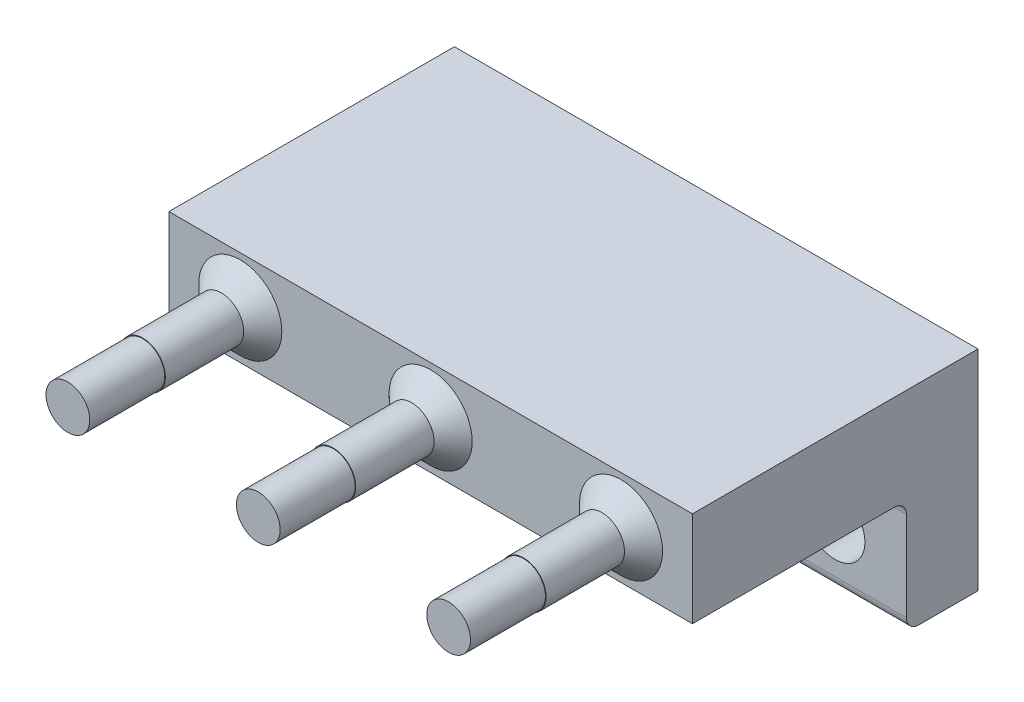
ISO-10303-21;
HEADER;
FILE_DESCRIPTION(('STEP AP214'),'2;1');
FILE_NAME('part.step','',(''),(''),'','','');
FILE_SCHEMA(('AUTOMOTIVE_DESIGN { 1 0 10303 214 1 1 1 1 }'));
ENDSEC;
DATA;
#1=APPLICATION_CONTEXT('core data for automotive mechanical design processes');
#2=APPLICATION_PROTOCOL_DEFINITION('international standard','automotive_design',2000,#1);
#3=PRODUCT_CONTEXT('',#1,'mechanical');
#4=PRODUCT('Part','Part','',(#3));
#5=PRODUCT_RELATED_PRODUCT_CATEGORY('part','',(#4));
#6=PRODUCT_DEFINITION_FORMATION('','',#4);
#7=PRODUCT_DEFINITION_CONTEXT('part definition',#1,'design');
#8=PRODUCT_DEFINITION('design','',#6,#7);
#9=PRODUCT_DEFINITION_SHAPE('','',#8);
#10=(LENGTH_UNIT() NAMED_UNIT(*) SI_UNIT(.MILLI.,.METRE.));
#11=(NAMED_UNIT(*) PLANE_ANGLE_UNIT() SI_UNIT($,.RADIAN.));
#12=(NAMED_UNIT(*) SI_UNIT($,.STERADIAN.) SOLID_ANGLE_UNIT());
#13=UNCERTAINTY_MEASURE_WITH_UNIT(LENGTH_MEASURE(1.E-05),#10,'distance_accuracy_value','');
#14=(GEOMETRIC_REPRESENTATION_CONTEXT(3) GLOBAL_UNCERTAINTY_ASSIGNED_CONTEXT((#13)) GLOBAL_UNIT_ASSIGNED_CONTEXT((#10,
#11,#12)) REPRESENTATION_CONTEXT('',''));
#15=CARTESIAN_POINT('',(0.,0.,0.));
#16=DIRECTION('',(0.,0.,1.));
#17=DIRECTION('',(1.,0.,0.));
#18=AXIS2_PLACEMENT_3D('',#15,#16,#17);
#19=CARTESIAN_POINT('',(23.8125,11.1125,0.));
#20=DIRECTION('',(0.,1.,0.));
#21=DIRECTION('',(1.,0.,0.));
#22=AXIS2_PLACEMENT_3D('',#19,#20,#21);
#23=PLANE('',#22);
#24=DIRECTION('',(-1.,0.,0.));
#25=VECTOR('',#24,1.);
#26=CARTESIAN_POINT('',(23.8125,11.1125,0.));
#27=LINE('',#26,#25);
#28=CARTESIAN_POINT('',(23.8125,11.1125,0.));
#29=VERTEX_POINT('',#28);
#30=CARTESIAN_POINT('',(-11.1125,11.1125,0.));
#31=VERTEX_POINT('',#30);
#32=EDGE_CURVE('E336',#29,#31,#27,.T.);
#33=ORIENTED_EDGE('',*,*,#32,.T.);
#34=DIRECTION('',(0.,0.,1.));
#35=VECTOR('',#34,1.);
#36=CARTESIAN_POINT('',(-11.1125,11.1125,0.));
#37=LINE('',#36,#35);
#38=CARTESIAN_POINT('',(-11.1125,11.1125,19.05));
#39=VERTEX_POINT('',#38);
#40=EDGE_CURVE('E307',#31,#39,#37,.T.);
#41=ORIENTED_EDGE('',*,*,#40,.T.);
#42=DIRECTION('',(-1.,0.,0.));
#43=VECTOR('',#42,1.);
#44=CARTESIAN_POINT('',(23.8125,11.1125,19.05));
#45=LINE('',#44,#43);
#46=CARTESIAN_POINT('',(23.8125,11.1125,19.05));
#47=VERTEX_POINT('',#46);
#48=EDGE_CURVE('E248',#47,#39,#45,.T.);
#49=ORIENTED_EDGE('',*,*,#48,.F.);
#50=DIRECTION('',(0.,0.,1.));
#51=VECTOR('',#50,1.);
#52=CARTESIAN_POINT('',(23.8125,11.1125,0.));
#53=LINE('',#52,#51);
#54=EDGE_CURVE('E289',#29,#47,#53,.T.);
#55=ORIENTED_EDGE('',*,*,#54,.F.);
#56=EDGE_LOOP('',(#33,#41,#49,#55));
#57=FACE_BOUND('',#56,.T.);
#58=ADVANCED_FACE('F17',(#57),#23,.T.);
#59=CARTESIAN_POINT('',(19.05,7.93749864998746,25.55));
#60=DIRECTION('',(0.,0.,1.));
#61=DIRECTION('',(1.,0.,0.));
#62=AXIS2_PLACEMENT_3D('',#59,#60,#61);
#63=PLANE('',#62);
#64=CARTESIAN_POINT('',(19.05,7.93749864998746,25.55));
#65=DIRECTION('',(0.,0.,-1.));
#66=DIRECTION('',(1.,0.,0.));
#67=AXIS2_PLACEMENT_3D('',#64,#65,#66);
#68=CIRCLE('',#67,1.46);
#69=CARTESIAN_POINT('',(17.59,7.93749864998746,25.55));
#70=VERTEX_POINT('',#69);
#71=EDGE_CURVE('E374',#70,#70,#68,.T.);
#72=ORIENTED_EDGE('',*,*,#71,.T.);
#73=EDGE_LOOP('',(#72));
#74=FACE_BOUND('',#73,.T.);
#75=CARTESIAN_POINT('',(19.05,7.93749864998746,25.55));
#76=DIRECTION('',(0.,0.,1.));
#77=DIRECTION('',(1.,0.,0.));
#78=AXIS2_PLACEMENT_3D('',#75,#76,#77);
#79=CIRCLE('',#78,1.5);
#80=CARTESIAN_POINT('',(17.55,7.93749864998746,25.55));
#81=VERTEX_POINT('',#80);
#82=EDGE_CURVE('E322',#81,#81,#79,.T.);
#83=ORIENTED_EDGE('',*,*,#82,.T.);
#84=EDGE_LOOP('',(#83));
#85=FACE_BOUND('',#84,.T.);
#86=ADVANCED_FACE('F452',(#74,#85),#63,.T.);
#87=CARTESIAN_POINT('',(6.35000000000015,7.93749875150671,25.55));
#88=DIRECTION('',(0.,0.,1.));
#89=DIRECTION('',(1.,0.,0.));
#90=AXIS2_PLACEMENT_3D('',#87,#88,#89);
#91=PLANE('',#90);
#92=CARTESIAN_POINT('',(6.35000000000015,7.93749875150671,25.55));
#93=DIRECTION('',(0.,0.,-1.));
#94=DIRECTION('',(1.,0.,0.));
#95=AXIS2_PLACEMENT_3D('',#92,#93,#94);
#96=CIRCLE('',#95,1.46);
#97=CARTESIAN_POINT('',(4.89000000000018,7.93749875150671,25.55));
#98=VERTEX_POINT('',#97);
#99=EDGE_CURVE('E288',#98,#98,#96,.T.);
#100=ORIENTED_EDGE('',*,*,#99,.T.);
#101=EDGE_LOOP('',(#100));
#102=FACE_BOUND('',#101,.T.);
#103=CARTESIAN_POINT('',(6.35000000000015,7.93749875150671,25.55));
#104=DIRECTION('',(0.,0.,1.));
#105=DIRECTION('',(1.,0.,0.));
#106=AXIS2_PLACEMENT_3D('',#103,#104,#105);
#107=CIRCLE('',#106,1.5);
#108=CARTESIAN_POINT('',(4.85000000000016,7.93749875150671,25.55));
#109=VERTEX_POINT('',#108);
#110=EDGE_CURVE('E415',#109,#109,#107,.T.);
#111=ORIENTED_EDGE('',*,*,#110,.T.);
#112=EDGE_LOOP('',(#111));
#113=FACE_BOUND('',#112,.T.);
#114=ADVANCED_FACE('F448',(#102,#113),#91,.T.);
#115=CARTESIAN_POINT('',(-6.35,7.93749864998746,25.55));
#116=DIRECTION('',(0.,0.,1.));
#117=DIRECTION('',(1.,0.,0.));
#118=AXIS2_PLACEMENT_3D('',#115,#116,#117);
#119=PLANE('',#118);
#120=CARTESIAN_POINT('',(-6.35,7.93749864998746,25.55));
#121=DIRECTION('',(0.,0.,-1.));
#122=DIRECTION('',(1.,0.,0.));
#123=AXIS2_PLACEMENT_3D('',#120,#121,#122);
#124=CIRCLE('',#123,1.46);
#125=CARTESIAN_POINT('',(-7.81,7.93749864998746,25.55));
#126=VERTEX_POINT('',#125);
#127=EDGE_CURVE('E302',#126,#126,#124,.T.);
#128=ORIENTED_EDGE('',*,*,#127,.T.);
#129=EDGE_LOOP('',(#128));
#130=FACE_BOUND('',#129,.T.);
#131=CARTESIAN_POINT('',(-6.35,7.93749864998746,25.55));
#132=DIRECTION('',(0.,0.,1.));
#133=DIRECTION('',(1.,0.,0.));
#134=AXIS2_PLACEMENT_3D('',#131,#132,#133);
#135=CIRCLE('',#134,1.5);
#136=CARTESIAN_POINT('',(-7.85,7.93749864998746,25.55));
#137=VERTEX_POINT('',#136);
#138=EDGE_CURVE('E26',#137,#137,#135,.T.);
#139=ORIENTED_EDGE('',*,*,#138,.T.);
#140=EDGE_LOOP('',(#139));
#141=FACE_BOUND('',#140,.T.);
#142=ADVANCED_FACE('F438',(#130,#141),#119,.T.);
#143=CARTESIAN_POINT('',(-6.35,7.93749864998746,19.05));
#144=DIRECTION('',(0.,0.,1.));
#145=DIRECTION('',(1.,0.,0.));
#146=AXIS2_PLACEMENT_3D('',#143,#144,#145);
#147=CYLINDRICAL_SURFACE('',#146,1.5);
#148=ORIENTED_EDGE('',*,*,#138,.F.);
#149=DIRECTION('',(0.,0.,-1.));
#150=VECTOR('',#149,1.);
#151=CARTESIAN_POINT('',(-7.85,7.93749864998746,19.05));
#152=LINE('',#151,#150);
#153=CARTESIAN_POINT('',(-7.85,7.93749864998746,20.32));
#154=VERTEX_POINT('',#153);
#155=EDGE_CURVE('E11',#137,#154,#152,.T.);
#156=ORIENTED_EDGE('',*,*,#155,.T.);
#157=CARTESIAN_POINT('',(-6.35,7.93749864998746,20.32));
#158=DIRECTION('',(0.,0.,-1.));
#159=DIRECTION('',(-1.,0.,0.));
#160=AXIS2_PLACEMENT_3D('',#157,#158,#159);
#161=CIRCLE('',#160,1.5);
#162=CARTESIAN_POINT('',(-4.85,7.93749864998746,20.32));
#163=VERTEX_POINT('',#162);
#164=EDGE_CURVE('E235',#163,#154,#161,.T.);
#165=ORIENTED_EDGE('',*,*,#164,.F.);
#166=CARTESIAN_POINT('',(-6.35,7.93749864998746,20.32));
#167=DIRECTION('',(0.,0.,-1.));
#168=DIRECTION('',(-1.,0.,0.));
#169=AXIS2_PLACEMENT_3D('',#166,#167,#168);
#170=CIRCLE('',#169,1.5);
#171=EDGE_CURVE('E282',#154,#163,#170,.T.);
#172=ORIENTED_EDGE('',*,*,#171,.F.);
#173=ORIENTED_EDGE('',*,*,#155,.F.);
#174=EDGE_LOOP('',(#148,#156,#165,#172,#173));
#175=FACE_BOUND('',#174,.T.);
#176=ADVANCED_FACE('F436',(#175),#147,.T.);
#177=CARTESIAN_POINT('',(-6.35,7.93749864998746,19.685));
#178=DIRECTION('',(0.,0.,-1.));
#179=DIRECTION('',(-1.,0.,0.));
#180=AXIS2_PLACEMENT_3D('',#177,#178,#179);
#181=CONICAL_SURFACE('',#180,2.135,0.785398163397448);
#182=CARTESIAN_POINT('',(-6.35,7.93749864998746,19.05));
#183=DIRECTION('',(0.,0.,1.));
#184=DIRECTION('',(-1.,0.,0.));
#185=AXIS2_PLACEMENT_3D('',#182,#183,#184);
#186=CIRCLE('',#185,2.77);
#187=CARTESIAN_POINT('',(-3.58,7.93749864998746,19.05));
#188=VERTEX_POINT('',#187);
#189=EDGE_CURVE('E273',#188,#188,#186,.T.);
#190=ORIENTED_EDGE('',*,*,#189,.T.);
#191=DIRECTION('',(-0.707106781186548,0.,0.707106781186548));
#192=VECTOR('',#191,1.);
#193=CARTESIAN_POINT('',(-4.215,7.93749864998746,19.685));
#194=LINE('',#193,#192);
#195=EDGE_CURVE('E20',#188,#163,#194,.T.);
#196=ORIENTED_EDGE('',*,*,#195,.T.);
#197=ORIENTED_EDGE('',*,*,#164,.T.);
#198=ORIENTED_EDGE('',*,*,#171,.T.);
#199=ORIENTED_EDGE('',*,*,#195,.F.);
#200=EDGE_LOOP('',(#190,#196,#197,#198,#199));
#201=FACE_BOUND('',#200,.T.);
#202=ADVANCED_FACE('F435',(#201),#181,.T.);
#203=CARTESIAN_POINT('',(6.35000000000015,7.93749875150671,19.05));
#204=DIRECTION('',(0.,0.,1.));
#205=DIRECTION('',(1.,0.,0.));
#206=AXIS2_PLACEMENT_3D('',#203,#204,#205);
#207=CYLINDRICAL_SURFACE('',#206,1.5);
#208=ORIENTED_EDGE('',*,*,#110,.F.);
#209=DIRECTION('',(0.,0.,-1.));
#210=VECTOR('',#209,1.);
#211=CARTESIAN_POINT('',(4.85000000000016,7.93749875150671,19.05));
#212=LINE('',#211,#210);
#213=CARTESIAN_POINT('',(4.85000000000016,7.93749875150671,20.32));
#214=VERTEX_POINT('',#213);
#215=EDGE_CURVE('E418',#109,#214,#212,.T.);
#216=ORIENTED_EDGE('',*,*,#215,.T.);
#217=CARTESIAN_POINT('',(6.35000000000015,7.93749875150671,20.32));
#218=DIRECTION('',(0.,0.,-1.));
#219=DIRECTION('',(-1.,0.,0.));
#220=AXIS2_PLACEMENT_3D('',#217,#218,#219);
#221=CIRCLE('',#220,1.5);
#222=CARTESIAN_POINT('',(7.85000000000017,7.93749875150671,20.32));
#223=VERTEX_POINT('',#222);
#224=EDGE_CURVE('E408',#223,#214,#221,.T.);
#225=ORIENTED_EDGE('',*,*,#224,.F.);
#226=CARTESIAN_POINT('',(6.35000000000015,7.93749875150671,20.32));
#227=DIRECTION('',(0.,0.,-1.));
#228=DIRECTION('',(-1.,0.,0.));
#229=AXIS2_PLACEMENT_3D('',#226,#227,#228);
#230=CIRCLE('',#229,1.5);
#231=EDGE_CURVE('E412',#214,#223,#230,.T.);
#232=ORIENTED_EDGE('',*,*,#231,.F.);
#233=ORIENTED_EDGE('',*,*,#215,.F.);
#234=EDGE_LOOP('',(#208,#216,#225,#232,#233));
#235=FACE_BOUND('',#234,.T.);
#236=ADVANCED_FACE('F446',(#235),#207,.T.);
#237=CARTESIAN_POINT('',(6.35000000000015,7.93749875150671,19.685));
#238=DIRECTION('',(0.,0.,-1.));
#239=DIRECTION('',(-1.,0.,0.));
#240=AXIS2_PLACEMENT_3D('',#237,#238,#239);
#241=CONICAL_SURFACE('',#240,2.135,0.785398163397448);
#242=CARTESIAN_POINT('',(6.35000000000015,7.93749875150671,19.05));
#243=DIRECTION('',(0.,0.,1.));
#244=DIRECTION('',(-1.,0.,0.));
#245=AXIS2_PLACEMENT_3D('',#242,#243,#244);
#246=CIRCLE('',#245,2.77);
#247=CARTESIAN_POINT('',(9.12000000000017,7.93749875150671,19.05));
#248=VERTEX_POINT('',#247);
#249=EDGE_CURVE('E269',#248,#248,#246,.T.);
#250=ORIENTED_EDGE('',*,*,#249,.T.);
#251=DIRECTION('',(-0.707106781186548,0.,0.707106781186548));
#252=VECTOR('',#251,1.);
#253=CARTESIAN_POINT('',(8.48500000000017,7.93749875150671,19.685));
#254=LINE('',#253,#252);
#255=EDGE_CURVE('E404',#248,#223,#254,.T.);
#256=ORIENTED_EDGE('',*,*,#255,.T.);
#257=ORIENTED_EDGE('',*,*,#224,.T.);
#258=ORIENTED_EDGE('',*,*,#231,.T.);
#259=ORIENTED_EDGE('',*,*,#255,.F.);
#260=EDGE_LOOP('',(#250,#256,#257,#258,#259));
#261=FACE_BOUND('',#260,.T.);
#262=ADVANCED_FACE('F497',(#261),#241,.T.);
#263=CARTESIAN_POINT('',(19.05,7.93749864998746,19.05));
#264=DIRECTION('',(0.,0.,1.));
#265=DIRECTION('',(1.,0.,0.));
#266=AXIS2_PLACEMENT_3D('',#263,#264,#265);
#267=CYLINDRICAL_SURFACE('',#266,1.5);
#268=ORIENTED_EDGE('',*,*,#82,.F.);
#269=DIRECTION('',(0.,0.,-1.));
#270=VECTOR('',#269,1.);
#271=CARTESIAN_POINT('',(17.55,7.93749864998746,19.05));
#272=LINE('',#271,#270);
#273=CARTESIAN_POINT('',(17.55,7.93749864998746,20.32));
#274=VERTEX_POINT('',#273);
#275=EDGE_CURVE('E326',#81,#274,#272,.T.);
#276=ORIENTED_EDGE('',*,*,#275,.T.);
#277=CARTESIAN_POINT('',(19.05,7.93749864998746,20.32));
#278=DIRECTION('',(0.,0.,-1.));
#279=DIRECTION('',(-1.,0.,0.));
#280=AXIS2_PLACEMENT_3D('',#277,#278,#279);
#281=CIRCLE('',#280,1.5);
#282=CARTESIAN_POINT('',(20.55,7.93749864998746,20.32));
#283=VERTEX_POINT('',#282);
#284=EDGE_CURVE('E249',#283,#274,#281,.T.);
#285=ORIENTED_EDGE('',*,*,#284,.F.);
#286=CARTESIAN_POINT('',(19.05,7.93749864998746,20.32));
#287=DIRECTION('',(0.,0.,-1.));
#288=DIRECTION('',(-1.,0.,0.));
#289=AXIS2_PLACEMENT_3D('',#286,#287,#288);
#290=CIRCLE('',#289,1.5);
#291=EDGE_CURVE('E245',#274,#283,#290,.T.);
#292=ORIENTED_EDGE('',*,*,#291,.F.);
#293=ORIENTED_EDGE('',*,*,#275,.F.);
#294=EDGE_LOOP('',(#268,#276,#285,#292,#293));
#295=FACE_BOUND('',#294,.T.);
#296=ADVANCED_FACE('F545',(#295),#267,.T.);
#297=CARTESIAN_POINT('',(6.35,3.175,19.05));
#298=DIRECTION('',(0.,0.,1.));
#299=DIRECTION('',(1.,0.,0.));
#300=AXIS2_PLACEMENT_3D('',#297,#298,#299);
#301=PLANE('',#300);
#302=CARTESIAN_POINT('',(19.05,7.93749864998746,19.05));
#303=DIRECTION('',(0.,0.,1.));
#304=DIRECTION('',(-1.,0.,0.));
#305=AXIS2_PLACEMENT_3D('',#302,#303,#304);
#306=CIRCLE('',#305,2.77);
#307=CARTESIAN_POINT('',(21.82,7.93749864998746,19.05));
#308=VERTEX_POINT('',#307);
#309=EDGE_CURVE('E297',#308,#308,#306,.T.);
#310=ORIENTED_EDGE('',*,*,#309,.F.);
#311=EDGE_LOOP('',(#310));
#312=FACE_BOUND('',#311,.T.);
#313=ORIENTED_EDGE('',*,*,#189,.F.);
#314=EDGE_LOOP('',(#313));
#315=FACE_BOUND('',#314,.T.);
#316=ORIENTED_EDGE('',*,*,#249,.F.);
#317=EDGE_LOOP('',(#316));
#318=FACE_BOUND('',#317,.T.);
#319=DIRECTION('',(1.,0.,0.));
#320=VECTOR('',#319,1.);
#321=CARTESIAN_POINT('',(-2.38125,4.7625,19.05));
#322=LINE('',#321,#320);
#323=CARTESIAN_POINT('',(-11.1125,4.7625,19.05));
#324=VERTEX_POINT('',#323);
#325=CARTESIAN_POINT('',(23.8125,4.7625,19.05));
#326=VERTEX_POINT('',#325);
#327=EDGE_CURVE('E204',#324,#326,#322,.T.);
#328=ORIENTED_EDGE('',*,*,#327,.T.);
#329=DIRECTION('',(0.,1.,0.));
#330=VECTOR('',#329,1.);
#331=CARTESIAN_POINT('',(23.8125,-4.7625,19.05));
#332=LINE('',#331,#330);
#333=EDGE_CURVE('E262',#326,#47,#332,.T.);
#334=ORIENTED_EDGE('',*,*,#333,.T.);
#335=ORIENTED_EDGE('',*,*,#48,.T.);
#336=DIRECTION('',(0.,-1.,0.));
#337=VECTOR('',#336,1.);
#338=CARTESIAN_POINT('',(-11.1125,11.1125,19.05));
#339=LINE('',#338,#337);
#340=EDGE_CURVE('E210',#39,#324,#339,.T.);
#341=ORIENTED_EDGE('',*,*,#340,.T.);
#342=EDGE_LOOP('',(#328,#334,#335,#341));
#343=FACE_BOUND('',#342,.T.);
#344=ADVANCED_FACE('F467',(#312,#315,#318,#343),#301,.T.);
#345=CARTESIAN_POINT('',(19.05,7.93749864998746,19.685));
#346=DIRECTION('',(0.,0.,-1.));
#347=DIRECTION('',(-1.,0.,0.));
#348=AXIS2_PLACEMENT_3D('',#345,#346,#347);
#349=CONICAL_SURFACE('',#348,2.135,0.785398163397448);
#350=ORIENTED_EDGE('',*,*,#309,.T.);
#351=DIRECTION('',(-0.707106781186548,0.,0.707106781186548));
#352=VECTOR('',#351,1.);
#353=CARTESIAN_POINT('',(21.185,7.93749864998746,19.685));
#354=LINE('',#353,#352);
#355=EDGE_CURVE('E301',#308,#283,#354,.T.);
#356=ORIENTED_EDGE('',*,*,#355,.T.);
#357=ORIENTED_EDGE('',*,*,#284,.T.);
#358=ORIENTED_EDGE('',*,*,#291,.T.);
#359=ORIENTED_EDGE('',*,*,#355,.F.);
#360=EDGE_LOOP('',(#350,#356,#357,#358,#359));
#361=FACE_BOUND('',#360,.T.);
#362=ADVANCED_FACE('F538',(#361),#349,.T.);
#363=CARTESIAN_POINT('',(-6.35,7.93749864998746,30.55));
#364=DIRECTION('',(0.,0.,1.));
#365=DIRECTION('',(1.,0.,0.));
#366=AXIS2_PLACEMENT_3D('',#363,#364,#365);
#367=PLANE('',#366);
#368=CARTESIAN_POINT('',(-6.35,7.93749864998746,30.55));
#369=DIRECTION('',(0.,0.,1.));
#370=DIRECTION('',(1.,0.,0.));
#371=AXIS2_PLACEMENT_3D('',#368,#369,#370);
#372=CIRCLE('',#371,1.46);
#373=CARTESIAN_POINT('',(-7.81,7.93749864998746,30.55));
#374=VERTEX_POINT('',#373);
#375=EDGE_CURVE('E283',#374,#374,#372,.T.);
#376=ORIENTED_EDGE('',*,*,#375,.T.);
#377=EDGE_LOOP('',(#376));
#378=FACE_BOUND('',#377,.T.);
#379=ADVANCED_FACE('F534',(#378),#367,.T.);
#380=CARTESIAN_POINT('',(-6.35,7.93749864998746,25.55));
#381=DIRECTION('',(0.,0.,1.));
#382=DIRECTION('',(1.,0.,0.));
#383=AXIS2_PLACEMENT_3D('',#380,#381,#382);
#384=CYLINDRICAL_SURFACE('',#383,1.46);
#385=ORIENTED_EDGE('',*,*,#375,.F.);
#386=DIRECTION('',(0.,0.,-1.));
#387=VECTOR('',#386,1.);
#388=CARTESIAN_POINT('',(-7.81,7.93749864998746,25.55));
#389=LINE('',#388,#387);
#390=EDGE_CURVE('E287',#374,#126,#389,.T.);
#391=ORIENTED_EDGE('',*,*,#390,.T.);
#392=ORIENTED_EDGE('',*,*,#127,.F.);
#393=ORIENTED_EDGE('',*,*,#390,.F.);
#394=EDGE_LOOP('',(#385,#391,#392,#393));
#395=FACE_BOUND('',#394,.T.);
#396=ADVANCED_FACE('F530',(#395),#384,.T.);
#397=CARTESIAN_POINT('',(6.35000000000015,7.93749875150671,30.55));
#398=DIRECTION('',(0.,0.,1.));
#399=DIRECTION('',(1.,0.,0.));
#400=AXIS2_PLACEMENT_3D('',#397,#398,#399);
#401=PLANE('',#400);
#402=CARTESIAN_POINT('',(6.35000000000015,7.93749875150671,30.55));
#403=DIRECTION('',(0.,0.,1.));
#404=DIRECTION('',(1.,0.,0.));
#405=AXIS2_PLACEMENT_3D('',#402,#403,#404);
#406=CIRCLE('',#405,1.46);
#407=CARTESIAN_POINT('',(4.89000000000018,7.93749875150671,30.55));
#408=VERTEX_POINT('',#407);
#409=EDGE_CURVE('E341',#408,#408,#406,.T.);
#410=ORIENTED_EDGE('',*,*,#409,.T.);
#411=EDGE_LOOP('',(#410));
#412=FACE_BOUND('',#411,.T.);
#413=ADVANCED_FACE('F520',(#412),#401,.T.);
#414=CARTESIAN_POINT('',(6.35000000000015,7.93749875150671,25.55));
#415=DIRECTION('',(0.,0.,1.));
#416=DIRECTION('',(1.,0.,0.));
#417=AXIS2_PLACEMENT_3D('',#414,#415,#416);
#418=CYLINDRICAL_SURFACE('',#417,1.46);
#419=ORIENTED_EDGE('',*,*,#409,.F.);
#420=DIRECTION('',(0.,0.,-1.));
#421=VECTOR('',#420,1.);
#422=CARTESIAN_POINT('',(4.89000000000018,7.93749875150671,25.55));
#423=LINE('',#422,#421);
#424=EDGE_CURVE('E337',#408,#98,#423,.T.);
#425=ORIENTED_EDGE('',*,*,#424,.T.);
#426=ORIENTED_EDGE('',*,*,#99,.F.);
#427=ORIENTED_EDGE('',*,*,#424,.F.);
#428=EDGE_LOOP('',(#419,#425,#426,#427));
#429=FACE_BOUND('',#428,.T.);
#430=ADVANCED_FACE('F516',(#429),#418,.T.);
#431=CARTESIAN_POINT('',(19.05,7.93749864998746,30.55));
#432=DIRECTION('',(0.,0.,1.));
#433=DIRECTION('',(1.,0.,0.));
#434=AXIS2_PLACEMENT_3D('',#431,#432,#433);
#435=PLANE('',#434);
#436=CARTESIAN_POINT('',(19.05,7.93749864998746,30.55));
#437=DIRECTION('',(0.,0.,1.));
#438=DIRECTION('',(1.,0.,0.));
#439=AXIS2_PLACEMENT_3D('',#436,#437,#438);
#440=CIRCLE('',#439,1.46);
#441=CARTESIAN_POINT('',(17.59,7.93749864998746,30.55));
#442=VERTEX_POINT('',#441);
#443=EDGE_CURVE('E370',#442,#442,#440,.T.);
#444=ORIENTED_EDGE('',*,*,#443,.T.);
#445=EDGE_LOOP('',(#444));
#446=FACE_BOUND('',#445,.T.);
#447=ADVANCED_FACE('F519',(#446),#435,.T.);
#448=CARTESIAN_POINT('',(19.05,7.93749864998746,25.55));
#449=DIRECTION('',(0.,0.,1.));
#450=DIRECTION('',(1.,0.,0.));
#451=AXIS2_PLACEMENT_3D('',#448,#449,#450);
#452=CYLINDRICAL_SURFACE('',#451,1.46);
#453=ORIENTED_EDGE('',*,*,#443,.F.);
#454=DIRECTION('',(0.,0.,-1.));
#455=VECTOR('',#454,1.);
#456=CARTESIAN_POINT('',(17.59,7.93749864998746,25.55));
#457=LINE('',#456,#455);
#458=EDGE_CURVE('E378',#442,#70,#457,.T.);
#459=ORIENTED_EDGE('',*,*,#458,.T.);
#460=ORIENTED_EDGE('',*,*,#71,.F.);
#461=ORIENTED_EDGE('',*,*,#458,.F.);
#462=EDGE_LOOP('',(#453,#459,#460,#461));
#463=FACE_BOUND('',#462,.T.);
#464=ADVANCED_FACE('F492',(#463),#452,.T.);
#465=CARTESIAN_POINT('',(-11.1125,4.7625,19.05));
#466=DIRECTION('',(0.,1.,0.));
#467=DIRECTION('',(1.,0.,0.));
#468=AXIS2_PLACEMENT_3D('',#465,#466,#467);
#469=PLANE('',#468);
#470=DIRECTION('',(-1.,0.,0.));
#471=VECTOR('',#470,1.);
#472=CARTESIAN_POINT('',(-2.18408298609877,4.7625,5.6007));
#473=LINE('',#472,#471);
#474=CARTESIAN_POINT('',(23.8125,4.7625,5.6007));
#475=VERTEX_POINT('',#474);
#476=CARTESIAN_POINT('',(-11.1125,4.7625,5.6007));
#477=VERTEX_POINT('',#476);
#478=EDGE_CURVE('E202',#475,#477,#473,.T.);
#479=ORIENTED_EDGE('',*,*,#478,.F.);
#480=DIRECTION('',(0.,0.,-1.));
#481=VECTOR('',#480,1.);
#482=CARTESIAN_POINT('',(23.8125,4.7625,9.525));
#483=LINE('',#482,#481);
#484=EDGE_CURVE('E254',#326,#475,#483,.T.);
#485=ORIENTED_EDGE('',*,*,#484,.F.);
#486=ORIENTED_EDGE('',*,*,#327,.F.);
#487=DIRECTION('',(0.,0.,1.));
#488=VECTOR('',#487,1.);
#489=CARTESIAN_POINT('',(-11.1125,4.7625,9.525));
#490=LINE('',#489,#488);
#491=EDGE_CURVE('E198',#477,#324,#490,.T.);
#492=ORIENTED_EDGE('',*,*,#491,.F.);
#493=EDGE_LOOP('',(#479,#485,#486,#492));
#494=FACE_BOUND('',#493,.T.);
#495=ADVANCED_FACE('F200',(#494),#469,.F.);
#496=CARTESIAN_POINT('',(6.35,0.952499999999985,4.7752));
#497=DIRECTION('',(0.,0.,-1.));
#498=DIRECTION('',(1.,0.,0.));
#499=AXIS2_PLACEMENT_3D('',#496,#497,#498);
#500=CYLINDRICAL_SURFACE('',#499,1.9939);
#501=CARTESIAN_POINT('',(6.35,0.952499999999985,4.7752));
#502=DIRECTION('',(0.,0.,-1.));
#503=DIRECTION('',(1.,0.,0.));
#504=AXIS2_PLACEMENT_3D('',#501,#502,#503);
#505=CIRCLE('',#504,1.9939);
#506=CARTESIAN_POINT('',(4.3561,0.952499999999985,4.7752));
#507=VERTEX_POINT('',#506);
#508=EDGE_CURVE('E255',#507,#507,#505,.T.);
#509=ORIENTED_EDGE('',*,*,#508,.F.);
#510=DIRECTION('',(0.,0.,-1.));
#511=VECTOR('',#510,1.);
#512=CARTESIAN_POINT('',(4.3561,0.952499999999985,4.7752));
#513=LINE('',#512,#511);
#514=CARTESIAN_POINT('',(4.3561,0.952499999999985,0.));
#515=VERTEX_POINT('',#514);
#516=EDGE_CURVE('E365',#507,#515,#513,.T.);
#517=ORIENTED_EDGE('',*,*,#516,.T.);
#518=CARTESIAN_POINT('',(6.35,0.952499999999985,0.));
#519=DIRECTION('',(0.,0.,1.));
#520=DIRECTION('',(1.,0.,0.));
#521=AXIS2_PLACEMENT_3D('',#518,#519,#520);
#522=CIRCLE('',#521,1.9939);
#523=EDGE_CURVE('E345',#515,#515,#522,.T.);
#524=ORIENTED_EDGE('',*,*,#523,.F.);
#525=ORIENTED_EDGE('',*,*,#516,.F.);
#526=EDGE_LOOP('',(#509,#517,#524,#525));
#527=FACE_BOUND('',#526,.T.);
#528=ADVANCED_FACE('F512',(#527),#500,.F.);
#529=CARTESIAN_POINT('',(19.05,0.952499999999985,4.7752));
#530=DIRECTION('',(0.,0.,-1.));
#531=DIRECTION('',(1.,0.,0.));
#532=AXIS2_PLACEMENT_3D('',#529,#530,#531);
#533=CYLINDRICAL_SURFACE('',#532,1.9939);
#534=CARTESIAN_POINT('',(19.05,0.952499999999985,4.7752));
#535=DIRECTION('',(0.,0.,-1.));
#536=DIRECTION('',(1.,0.,0.));
#537=AXIS2_PLACEMENT_3D('',#534,#535,#536);
#538=CIRCLE('',#537,1.9939);
#539=CARTESIAN_POINT('',(17.0561,0.952499999999985,4.7752));
#540=VERTEX_POINT('',#539);
#541=EDGE_CURVE('E242',#540,#540,#538,.T.);
#542=ORIENTED_EDGE('',*,*,#541,.F.);
#543=DIRECTION('',(0.,0.,-1.));
#544=VECTOR('',#543,1.);
#545=CARTESIAN_POINT('',(17.0561,0.952499999999985,4.7752));
#546=LINE('',#545,#544);
#547=CARTESIAN_POINT('',(17.0561,0.952499999999985,0.));
#548=VERTEX_POINT('',#547);
#549=EDGE_CURVE('E306',#540,#548,#546,.T.);
#550=ORIENTED_EDGE('',*,*,#549,.T.);
#551=CARTESIAN_POINT('',(19.05,0.952499999999985,0.));
#552=DIRECTION('',(0.,0.,1.));
#553=DIRECTION('',(1.,0.,0.));
#554=AXIS2_PLACEMENT_3D('',#551,#552,#553);
#555=CIRCLE('',#554,1.9939);
#556=EDGE_CURVE('E351',#548,#548,#555,.T.);
#557=ORIENTED_EDGE('',*,*,#556,.F.);
#558=ORIENTED_EDGE('',*,*,#549,.F.);
#559=EDGE_LOOP('',(#542,#550,#557,#558));
#560=FACE_BOUND('',#559,.T.);
#561=ADVANCED_FACE('F503',(#560),#533,.F.);
#562=CARTESIAN_POINT('',(-6.35,0.952499999999985,4.7752));
#563=DIRECTION('',(0.,0.,-1.));
#564=DIRECTION('',(1.,0.,0.));
#565=AXIS2_PLACEMENT_3D('',#562,#563,#564);
#566=CYLINDRICAL_SURFACE('',#565,1.9939);
#567=CARTESIAN_POINT('',(-6.35,0.952499999999985,4.7752));
#568=DIRECTION('',(0.,0.,-1.));
#569=DIRECTION('',(1.,0.,0.));
#570=AXIS2_PLACEMENT_3D('',#567,#568,#569);
#571=CIRCLE('',#570,1.9939);
#572=CARTESIAN_POINT('',(-8.3439,0.952499999999985,4.7752));
#573=VERTEX_POINT('',#572);
#574=EDGE_CURVE('E237',#573,#573,#571,.T.);
#575=ORIENTED_EDGE('',*,*,#574,.F.);
#576=DIRECTION('',(0.,0.,-1.));
#577=VECTOR('',#576,1.);
#578=CARTESIAN_POINT('',(-8.3439,0.952499999999985,4.7752));
#579=LINE('',#578,#577);
#580=CARTESIAN_POINT('',(-8.3439,0.952499999999985,0.));
#581=VERTEX_POINT('',#580);
#582=EDGE_CURVE('E303',#573,#581,#579,.T.);
#583=ORIENTED_EDGE('',*,*,#582,.T.);
#584=CARTESIAN_POINT('',(-6.35,0.952499999999985,0.));
#585=DIRECTION('',(0.,0.,1.));
#586=DIRECTION('',(1.,0.,0.));
#587=AXIS2_PLACEMENT_3D('',#584,#585,#586);
#588=CIRCLE('',#587,1.9939);
#589=EDGE_CURVE('E211',#581,#581,#588,.T.);
#590=ORIENTED_EDGE('',*,*,#589,.F.);
#591=ORIENTED_EDGE('',*,*,#582,.F.);
#592=EDGE_LOOP('',(#575,#583,#590,#591));
#593=FACE_BOUND('',#592,.T.);
#594=ADVANCED_FACE('F500',(#593),#566,.F.);
#595=CARTESIAN_POINT('',(-11.1125,11.1125,0.));
#596=DIRECTION('',(-1.,0.,0.));
#597=DIRECTION('',(0.,0.,1.));
#598=AXIS2_PLACEMENT_3D('',#595,#596,#597);
#599=PLANE('',#598);
#600=CARTESIAN_POINT('',(-11.1125,-2.032,3.9497));
#601=DIRECTION('',(1.,0.,0.));
#602=DIRECTION('',(0.,-0.707106781186548,0.707106781186548));
#603=AXIS2_PLACEMENT_3D('',#600,#601,#602);
#604=CIRCLE('',#603,0.8255);
#605=CARTESIAN_POINT('',(-11.1125,-2.032,4.7752));
#606=VERTEX_POINT('',#605);
#607=CARTESIAN_POINT('',(-11.1125,-2.8575,3.9497));
#608=VERTEX_POINT('',#607);
#609=EDGE_CURVE('E296',#606,#608,#604,.T.);
#610=ORIENTED_EDGE('',*,*,#609,.F.);
#611=DIRECTION('',(0.,1.,0.));
#612=VECTOR('',#611,1.);
#613=CARTESIAN_POINT('',(-11.1125,4.69362383258276,4.7752));
#614=LINE('',#613,#612);
#615=CARTESIAN_POINT('',(-11.1125,3.937,4.7752));
#616=VERTEX_POINT('',#615);
#617=EDGE_CURVE('E221',#606,#616,#614,.T.);
#618=ORIENTED_EDGE('',*,*,#617,.T.);
#619=CARTESIAN_POINT('',(-11.1125,3.937,5.6007));
#620=DIRECTION('',(-1.,0.,0.));
#621=DIRECTION('',(0.,0.707106781186547,-0.707106781186548));
#622=AXIS2_PLACEMENT_3D('',#619,#620,#621);
#623=CIRCLE('',#622,0.8255);
#624=EDGE_CURVE('E217',#477,#616,#623,.T.);
#625=ORIENTED_EDGE('',*,*,#624,.F.);
#626=ORIENTED_EDGE('',*,*,#491,.T.);
#627=ORIENTED_EDGE('',*,*,#340,.F.);
#628=ORIENTED_EDGE('',*,*,#40,.F.);
#629=DIRECTION('',(0.,-1.,0.));
#630=VECTOR('',#629,1.);
#631=CARTESIAN_POINT('',(-11.1125,11.1125,0.));
#632=LINE('',#631,#630);
#633=CARTESIAN_POINT('',(-11.1125,-2.8575,0.));
#634=VERTEX_POINT('',#633);
#635=EDGE_CURVE('E333',#31,#634,#632,.T.);
#636=ORIENTED_EDGE('',*,*,#635,.T.);
#637=DIRECTION('',(0.,0.,1.));
#638=VECTOR('',#637,1.);
#639=CARTESIAN_POINT('',(-11.1125,-2.8575,2.3876));
#640=LINE('',#639,#638);
#641=EDGE_CURVE('E250',#634,#608,#640,.T.);
#642=ORIENTED_EDGE('',*,*,#641,.T.);
#643=EDGE_LOOP('',(#610,#618,#625,#626,#627,#628,#636,#642));
#644=FACE_BOUND('',#643,.T.);
#645=ADVANCED_FACE('F223',(#644),#599,.T.);
#646=CARTESIAN_POINT('',(6.35,3.175,0.));
#647=DIRECTION('',(0.,0.,1.));
#648=DIRECTION('',(1.,0.,0.));
#649=AXIS2_PLACEMENT_3D('',#646,#647,#648);
#650=PLANE('',#649);
#651=ORIENTED_EDGE('',*,*,#589,.T.);
#652=EDGE_LOOP('',(#651));
#653=FACE_BOUND('',#652,.T.);
#654=ORIENTED_EDGE('',*,*,#556,.T.);
#655=EDGE_LOOP('',(#654));
#656=FACE_BOUND('',#655,.T.);
#657=ORIENTED_EDGE('',*,*,#523,.T.);
#658=EDGE_LOOP('',(#657));
#659=FACE_BOUND('',#658,.T.);
#660=DIRECTION('',(-1.,0.,0.));
#661=VECTOR('',#660,1.);
#662=CARTESIAN_POINT('',(-2.38125000000003,-2.8575,0.));
#663=LINE('',#662,#661);
#664=CARTESIAN_POINT('',(23.8125,-2.8575,0.));
#665=VERTEX_POINT('',#664);
#666=EDGE_CURVE('E253',#665,#634,#663,.T.);
#667=ORIENTED_EDGE('',*,*,#666,.T.);
#668=ORIENTED_EDGE('',*,*,#635,.F.);
#669=ORIENTED_EDGE('',*,*,#32,.F.);
#670=DIRECTION('',(0.,1.,0.));
#671=VECTOR('',#670,1.);
#672=CARTESIAN_POINT('',(23.8125,-4.7625,0.));
#673=LINE('',#672,#671);
#674=EDGE_CURVE('E293',#665,#29,#673,.T.);
#675=ORIENTED_EDGE('',*,*,#674,.F.);
#676=EDGE_LOOP('',(#667,#668,#669,#675));
#677=FACE_BOUND('',#676,.T.);
#678=ADVANCED_FACE('F463',(#653,#656,#659,#677),#650,.F.);
#679=CARTESIAN_POINT('',(-11.1125,-2.8575,4.7752));
#680=DIRECTION('',(0.,1.,0.));
#681=DIRECTION('',(1.,0.,0.));
#682=AXIS2_PLACEMENT_3D('',#679,#680,#681);
#683=PLANE('',#682);
#684=DIRECTION('',(1.,0.,0.));
#685=VECTOR('',#684,1.);
#686=CARTESIAN_POINT('',(-2.18408298609877,-2.8575,3.9497));
#687=LINE('',#686,#685);
#688=CARTESIAN_POINT('',(23.8125,-2.8575,3.9497));
#689=VERTEX_POINT('',#688);
#690=EDGE_CURVE('E311',#608,#689,#687,.T.);
#691=ORIENTED_EDGE('',*,*,#690,.F.);
#692=ORIENTED_EDGE('',*,*,#641,.F.);
#693=ORIENTED_EDGE('',*,*,#666,.F.);
#694=DIRECTION('',(0.,0.,-1.));
#695=VECTOR('',#694,1.);
#696=CARTESIAN_POINT('',(23.8125,-2.8575,2.3876));
#697=LINE('',#696,#695);
#698=EDGE_CURVE('E315',#689,#665,#697,.T.);
#699=ORIENTED_EDGE('',*,*,#698,.F.);
#700=EDGE_LOOP('',(#691,#692,#693,#699));
#701=FACE_BOUND('',#700,.T.);
#702=ADVANCED_FACE('F473',(#701),#683,.F.);
#703=CARTESIAN_POINT('',(23.8125,-4.7625,0.));
#704=DIRECTION('',(1.,0.,0.));
#705=DIRECTION('',(0.,-1.,0.));
#706=AXIS2_PLACEMENT_3D('',#703,#704,#705);
#707=PLANE('',#706);
#708=CARTESIAN_POINT('',(23.8125,-2.032,3.9497));
#709=DIRECTION('',(-1.,0.,0.));
#710=DIRECTION('',(0.,-0.707106781186548,0.707106781186548));
#711=AXIS2_PLACEMENT_3D('',#708,#709,#710);
#712=CIRCLE('',#711,0.8255);
#713=CARTESIAN_POINT('',(23.8125,-2.032,4.7752));
#714=VERTEX_POINT('',#713);
#715=EDGE_CURVE('E241',#689,#714,#712,.T.);
#716=ORIENTED_EDGE('',*,*,#715,.F.);
#717=ORIENTED_EDGE('',*,*,#698,.T.);
#718=ORIENTED_EDGE('',*,*,#674,.T.);
#719=ORIENTED_EDGE('',*,*,#54,.T.);
#720=ORIENTED_EDGE('',*,*,#333,.F.);
#721=ORIENTED_EDGE('',*,*,#484,.T.);
#722=CARTESIAN_POINT('',(23.8125,3.937,5.6007));
#723=DIRECTION('',(1.,0.,0.));
#724=DIRECTION('',(0.,0.707106781186547,-0.707106781186548));
#725=AXIS2_PLACEMENT_3D('',#722,#723,#724);
#726=CIRCLE('',#725,0.8255);
#727=CARTESIAN_POINT('',(23.8125,3.937,4.7752));
#728=VERTEX_POINT('',#727);
#729=EDGE_CURVE('E219',#728,#475,#726,.T.);
#730=ORIENTED_EDGE('',*,*,#729,.F.);
#731=DIRECTION('',(0.,-1.,0.));
#732=VECTOR('',#731,1.);
#733=CARTESIAN_POINT('',(23.8125,-3.24387616741727,4.7752));
#734=LINE('',#733,#732);
#735=EDGE_CURVE('E258',#728,#714,#734,.T.);
#736=ORIENTED_EDGE('',*,*,#735,.T.);
#737=EDGE_LOOP('',(#716,#717,#718,#719,#720,#721,#730,#736));
#738=FACE_BOUND('',#737,.T.);
#739=ADVANCED_FACE('F471',(#738),#707,.T.);
#740=CARTESIAN_POINT('',(-2.18408298609877,-2.032,3.9497));
#741=DIRECTION('',(1.,0.,0.));
#742=DIRECTION('',(0.,-0.707106781186548,0.707106781186548));
#743=AXIS2_PLACEMENT_3D('',#740,#741,#742);
#744=CYLINDRICAL_SURFACE('',#743,0.8255);
#745=ORIENTED_EDGE('',*,*,#715,.T.);
#746=DIRECTION('',(-1.,0.,0.));
#747=VECTOR('',#746,1.);
#748=CARTESIAN_POINT('',(-2.18408298609877,-2.032,4.7752));
#749=LINE('',#748,#747);
#750=EDGE_CURVE('E265',#714,#606,#749,.T.);
#751=ORIENTED_EDGE('',*,*,#750,.T.);
#752=ORIENTED_EDGE('',*,*,#609,.T.);
#753=ORIENTED_EDGE('',*,*,#690,.T.);
#754=EDGE_LOOP('',(#745,#751,#752,#753));
#755=FACE_BOUND('',#754,.T.);
#756=ADVANCED_FACE('F475',(#755),#744,.T.);
#757=CARTESIAN_POINT('',(6.74433402780248,-1.72525233483449,4.7752));
#758=DIRECTION('',(0.,0.,-1.));
#759=DIRECTION('',(0.,-1.,0.));
#760=AXIS2_PLACEMENT_3D('',#757,#758,#759);
#761=PLANE('',#760);
#762=ORIENTED_EDGE('',*,*,#574,.T.);
#763=EDGE_LOOP('',(#762));
#764=FACE_BOUND('',#763,.T.);
#765=ORIENTED_EDGE('',*,*,#541,.T.);
#766=EDGE_LOOP('',(#765));
#767=FACE_BOUND('',#766,.T.);
#768=ORIENTED_EDGE('',*,*,#508,.T.);
#769=EDGE_LOOP('',(#768));
#770=FACE_BOUND('',#769,.T.);
#771=DIRECTION('',(1.,0.,0.));
#772=VECTOR('',#771,1.);
#773=CARTESIAN_POINT('',(-2.18408298609877,3.937,4.7752));
#774=LINE('',#773,#772);
#775=EDGE_CURVE('E227',#616,#728,#774,.T.);
#776=ORIENTED_EDGE('',*,*,#775,.F.);
#777=ORIENTED_EDGE('',*,*,#617,.F.);
#778=ORIENTED_EDGE('',*,*,#750,.F.);
#779=ORIENTED_EDGE('',*,*,#735,.F.);
#780=EDGE_LOOP('',(#776,#777,#778,#779));
#781=FACE_BOUND('',#780,.T.);
#782=ADVANCED_FACE('F478',(#764,#767,#770,#781),#761,.F.);
#783=CARTESIAN_POINT('',(-2.18408298609877,3.937,5.6007));
#784=DIRECTION('',(1.,0.,0.));
#785=DIRECTION('',(0.,0.707106781186547,-0.707106781186548));
#786=AXIS2_PLACEMENT_3D('',#783,#784,#785);
#787=CYLINDRICAL_SURFACE('',#786,0.8255);
#788=ORIENTED_EDGE('',*,*,#624,.T.);
#789=ORIENTED_EDGE('',*,*,#775,.T.);
#790=ORIENTED_EDGE('',*,*,#729,.T.);
#791=ORIENTED_EDGE('',*,*,#478,.T.);
#792=EDGE_LOOP('',(#788,#789,#790,#791));
#793=FACE_BOUND('',#792,.T.);
#794=ADVANCED_FACE('F215',(#793),#787,.F.);
#795=CLOSED_SHELL('',(#58,#86,#114,#142,#176,#202,#236,#262,#296,#344,#362,#379,#396,#413,#430,
#447,#464,#495,#528,#561,#594,#645,#678,#702,#739,#756,#782,#794));
#796=MANIFOLD_SOLID_BREP('B1',#795);
#797=ADVANCED_BREP_SHAPE_REPRESENTATION('',(#18,#796),#14);
#798=SHAPE_DEFINITION_REPRESENTATION(#9,#797);
ENDSEC;
END-ISO-10303-21;
